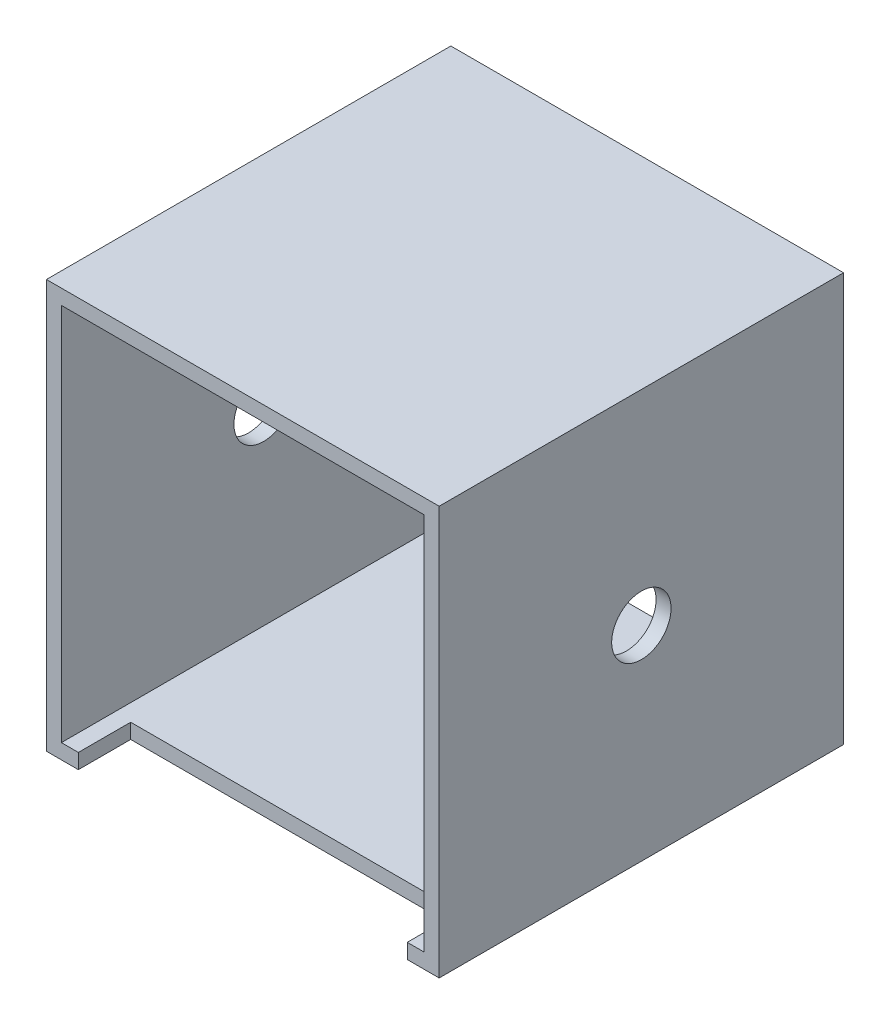
ISO-10303-21;
HEADER;
FILE_DESCRIPTION(('STEP AP214'),'2;1');
FILE_NAME('part.step','',(''),(''),'','','');
FILE_SCHEMA(('AUTOMOTIVE_DESIGN { 1 0 10303 214 1 1 1 1 }'));
ENDSEC;
DATA;
#1=APPLICATION_CONTEXT('core data for automotive mechanical design processes');
#2=APPLICATION_PROTOCOL_DEFINITION('international standard','automotive_design',2000,#1);
#3=PRODUCT_CONTEXT('',#1,'mechanical');
#4=PRODUCT('Part','Part','',(#3));
#5=PRODUCT_RELATED_PRODUCT_CATEGORY('part','',(#4));
#6=PRODUCT_DEFINITION_FORMATION('','',#4);
#7=PRODUCT_DEFINITION_CONTEXT('part definition',#1,'design');
#8=PRODUCT_DEFINITION('design','',#6,#7);
#9=PRODUCT_DEFINITION_SHAPE('','',#8);
#10=(LENGTH_UNIT() NAMED_UNIT(*) SI_UNIT(.MILLI.,.METRE.));
#11=(NAMED_UNIT(*) PLANE_ANGLE_UNIT() SI_UNIT($,.RADIAN.));
#12=(NAMED_UNIT(*) SI_UNIT($,.STERADIAN.) SOLID_ANGLE_UNIT());
#13=UNCERTAINTY_MEASURE_WITH_UNIT(LENGTH_MEASURE(1.E-05),#10,'distance_accuracy_value','');
#14=(GEOMETRIC_REPRESENTATION_CONTEXT(3) GLOBAL_UNCERTAINTY_ASSIGNED_CONTEXT((#13)) GLOBAL_UNIT_ASSIGNED_CONTEXT((#10,
#11,#12)) REPRESENTATION_CONTEXT('',''));
#15=CARTESIAN_POINT('',(0.,0.,0.));
#16=DIRECTION('',(0.,0.,1.));
#17=DIRECTION('',(1.,0.,0.));
#18=AXIS2_PLACEMENT_3D('',#15,#16,#17);
#19=CARTESIAN_POINT('',(0.,0.,68.707));
#20=DIRECTION('',(0.,0.,1.));
#21=DIRECTION('',(1.,0.,0.));
#22=AXIS2_PLACEMENT_3D('',#19,#20,#21);
#23=PLANE('',#22);
#24=DIRECTION('',(0.,1.,0.));
#25=VECTOR('',#24,1.);
#26=CARTESIAN_POINT('',(-27.94,-34.7091,68.707));
#27=LINE('',#26,#25);
#28=CARTESIAN_POINT('',(-27.94,-34.7091,68.707));
#29=VERTEX_POINT('',#28);
#30=CARTESIAN_POINT('',(-27.94,-32.1691,68.707));
#31=VERTEX_POINT('',#30);
#32=EDGE_CURVE('E148',#29,#31,#27,.T.);
#33=ORIENTED_EDGE('',*,*,#32,.T.);
#34=DIRECTION('',(1.,0.,0.));
#35=VECTOR('',#34,1.);
#36=CARTESIAN_POINT('',(0.,-32.1691,68.707));
#37=LINE('',#36,#35);
#38=CARTESIAN_POINT('',(-30.8229,-32.1691,68.707));
#39=VERTEX_POINT('',#38);
#40=EDGE_CURVE('E221',#39,#31,#37,.T.);
#41=ORIENTED_EDGE('',*,*,#40,.F.);
#42=DIRECTION('',(0.,-1.,0.));
#43=VECTOR('',#42,1.);
#44=CARTESIAN_POINT('',(-30.8229,0.,68.707));
#45=LINE('',#44,#43);
#46=CARTESIAN_POINT('',(-30.8229,32.1691,68.707));
#47=VERTEX_POINT('',#46);
#48=EDGE_CURVE('E238',#47,#39,#45,.T.);
#49=ORIENTED_EDGE('',*,*,#48,.F.);
#50=DIRECTION('',(-1.,0.,0.));
#51=VECTOR('',#50,1.);
#52=CARTESIAN_POINT('',(0.,32.1691,68.707));
#53=LINE('',#52,#51);
#54=CARTESIAN_POINT('',(30.8229,32.1691,68.707));
#55=VERTEX_POINT('',#54);
#56=EDGE_CURVE('E240',#55,#47,#53,.T.);
#57=ORIENTED_EDGE('',*,*,#56,.F.);
#58=DIRECTION('',(0.,1.,0.));
#59=VECTOR('',#58,1.);
#60=CARTESIAN_POINT('',(30.8229,0.,68.707));
#61=LINE('',#60,#59);
#62=CARTESIAN_POINT('',(30.8229,-32.1691,68.707));
#63=VERTEX_POINT('',#62);
#64=EDGE_CURVE('E225',#63,#55,#61,.T.);
#65=ORIENTED_EDGE('',*,*,#64,.F.);
#66=CARTESIAN_POINT('',(27.94,-32.1691,68.707));
#67=VERTEX_POINT('',#66);
#68=EDGE_CURVE('E237',#67,#63,#37,.T.);
#69=ORIENTED_EDGE('',*,*,#68,.F.);
#70=DIRECTION('',(0.,1.,0.));
#71=VECTOR('',#70,1.);
#72=CARTESIAN_POINT('',(27.94,-34.7091,68.707));
#73=LINE('',#72,#71);
#74=CARTESIAN_POINT('',(27.94,-34.7091,68.707));
#75=VERTEX_POINT('',#74);
#76=EDGE_CURVE('E72',#75,#67,#73,.T.);
#77=ORIENTED_EDGE('',*,*,#76,.F.);
#78=DIRECTION('',(1.,0.,0.));
#79=VECTOR('',#78,1.);
#80=CARTESIAN_POINT('',(-33.3629,-34.7091,68.707));
#81=LINE('',#80,#79);
#82=CARTESIAN_POINT('',(33.3629,-34.7091,68.707));
#83=VERTEX_POINT('',#82);
#84=EDGE_CURVE('E174',#75,#83,#81,.T.);
#85=ORIENTED_EDGE('',*,*,#84,.T.);
#86=DIRECTION('',(0.,1.,0.));
#87=VECTOR('',#86,1.);
#88=CARTESIAN_POINT('',(33.3629,-34.7091,68.707));
#89=LINE('',#88,#87);
#90=CARTESIAN_POINT('',(33.3629,34.7091,68.707));
#91=VERTEX_POINT('',#90);
#92=EDGE_CURVE('E191',#83,#91,#89,.T.);
#93=ORIENTED_EDGE('',*,*,#92,.T.);
#94=DIRECTION('',(-1.,0.,0.));
#95=VECTOR('',#94,1.);
#96=CARTESIAN_POINT('',(-33.3629,34.7091,68.707));
#97=LINE('',#96,#95);
#98=CARTESIAN_POINT('',(-33.3629,34.7091,68.707));
#99=VERTEX_POINT('',#98);
#100=EDGE_CURVE('E210',#91,#99,#97,.T.);
#101=ORIENTED_EDGE('',*,*,#100,.T.);
#102=DIRECTION('',(0.,-1.,0.));
#103=VECTOR('',#102,1.);
#104=CARTESIAN_POINT('',(-33.3629,-34.7091,68.707));
#105=LINE('',#104,#103);
#106=CARTESIAN_POINT('',(-33.3629,-34.7091,68.707));
#107=VERTEX_POINT('',#106);
#108=EDGE_CURVE('E171',#99,#107,#105,.T.);
#109=ORIENTED_EDGE('',*,*,#108,.T.);
#110=EDGE_CURVE('E164',#107,#29,#81,.T.);
#111=ORIENTED_EDGE('',*,*,#110,.T.);
#112=EDGE_LOOP('',(#33,#41,#49,#57,#65,#69,#77,#85,#93,#101,#109,#111));
#113=FACE_BOUND('',#112,.T.);
#114=ADVANCED_FACE('F57',(#113),#23,.T.);
#115=CARTESIAN_POINT('',(0.,0.,0.));
#116=DIRECTION('',(0.,0.,1.));
#117=DIRECTION('',(1.,0.,0.));
#118=AXIS2_PLACEMENT_3D('',#115,#116,#117);
#119=PLANE('',#118);
#120=DIRECTION('',(0.,1.,0.));
#121=VECTOR('',#120,1.);
#122=CARTESIAN_POINT('',(33.3629,-34.7091,0.));
#123=LINE('',#122,#121);
#124=CARTESIAN_POINT('',(33.3629,-34.7091,0.));
#125=VERTEX_POINT('',#124);
#126=CARTESIAN_POINT('',(33.3629,34.7091,0.));
#127=VERTEX_POINT('',#126);
#128=EDGE_CURVE('E182',#125,#127,#123,.T.);
#129=ORIENTED_EDGE('',*,*,#128,.F.);
#130=DIRECTION('',(1.,0.,0.));
#131=VECTOR('',#130,1.);
#132=CARTESIAN_POINT('',(-33.3629,-34.7091,0.));
#133=LINE('',#132,#131);
#134=CARTESIAN_POINT('',(-33.3629,-34.7091,0.));
#135=VERTEX_POINT('',#134);
#136=EDGE_CURVE('E190',#135,#125,#133,.T.);
#137=ORIENTED_EDGE('',*,*,#136,.F.);
#138=DIRECTION('',(0.,-1.,0.));
#139=VECTOR('',#138,1.);
#140=CARTESIAN_POINT('',(-33.3629,-34.7091,0.));
#141=LINE('',#140,#139);
#142=CARTESIAN_POINT('',(-33.3629,34.7091,0.));
#143=VERTEX_POINT('',#142);
#144=EDGE_CURVE('E188',#143,#135,#141,.T.);
#145=ORIENTED_EDGE('',*,*,#144,.F.);
#146=DIRECTION('',(-1.,0.,0.));
#147=VECTOR('',#146,1.);
#148=CARTESIAN_POINT('',(-33.3629,34.7091,0.));
#149=LINE('',#148,#147);
#150=EDGE_CURVE('E185',#127,#143,#149,.T.);
#151=ORIENTED_EDGE('',*,*,#150,.F.);
#152=EDGE_LOOP('',(#129,#137,#145,#151));
#153=FACE_BOUND('',#152,.T.);
#154=DIRECTION('',(0.,1.,0.));
#155=VECTOR('',#154,1.);
#156=CARTESIAN_POINT('',(30.8229,0.,0.));
#157=LINE('',#156,#155);
#158=CARTESIAN_POINT('',(30.8229,-32.1691,0.));
#159=VERTEX_POINT('',#158);
#160=CARTESIAN_POINT('',(30.8229,32.1691,0.));
#161=VERTEX_POINT('',#160);
#162=EDGE_CURVE('E232',#159,#161,#157,.T.);
#163=ORIENTED_EDGE('',*,*,#162,.T.);
#164=DIRECTION('',(-1.,0.,0.));
#165=VECTOR('',#164,1.);
#166=CARTESIAN_POINT('',(0.,32.1691,0.));
#167=LINE('',#166,#165);
#168=CARTESIAN_POINT('',(-30.8229,32.1691,0.));
#169=VERTEX_POINT('',#168);
#170=EDGE_CURVE('E229',#161,#169,#167,.T.);
#171=ORIENTED_EDGE('',*,*,#170,.T.);
#172=DIRECTION('',(0.,-1.,0.));
#173=VECTOR('',#172,1.);
#174=CARTESIAN_POINT('',(-30.8229,0.,0.));
#175=LINE('',#174,#173);
#176=CARTESIAN_POINT('',(-30.8229,-32.1691,0.));
#177=VERTEX_POINT('',#176);
#178=EDGE_CURVE('E226',#169,#177,#175,.T.);
#179=ORIENTED_EDGE('',*,*,#178,.T.);
#180=DIRECTION('',(1.,0.,0.));
#181=VECTOR('',#180,1.);
#182=CARTESIAN_POINT('',(0.,-32.1691,0.));
#183=LINE('',#182,#181);
#184=EDGE_CURVE('E222',#177,#159,#183,.T.);
#185=ORIENTED_EDGE('',*,*,#184,.T.);
#186=EDGE_LOOP('',(#163,#171,#179,#185));
#187=FACE_BOUND('',#186,.T.);
#188=ADVANCED_FACE('F202',(#153,#187),#119,.F.);
#189=CARTESIAN_POINT('',(33.3629,-34.7091,68.707));
#190=DIRECTION('',(-1.,0.,0.));
#191=DIRECTION('',(0.,0.,1.));
#192=AXIS2_PLACEMENT_3D('',#189,#190,#191);
#193=PLANE('',#192);
#194=CARTESIAN_POINT('',(33.3629,0.,34.3535));
#195=DIRECTION('',(1.,0.,0.));
#196=DIRECTION('',(0.,0.,-1.));
#197=AXIS2_PLACEMENT_3D('',#194,#195,#196);
#198=CIRCLE('',#197,5.04189999999999);
#199=CARTESIAN_POINT('',(33.3629,0.,29.3116));
#200=VERTEX_POINT('',#199);
#201=EDGE_CURVE('E251',#200,#200,#198,.T.);
#202=ORIENTED_EDGE('',*,*,#201,.F.);
#203=EDGE_LOOP('',(#202));
#204=FACE_BOUND('',#203,.T.);
#205=ORIENTED_EDGE('',*,*,#128,.T.);
#206=DIRECTION('',(0.,0.,-1.));
#207=VECTOR('',#206,1.);
#208=CARTESIAN_POINT('',(33.3629,34.7091,68.707));
#209=LINE('',#208,#207);
#210=EDGE_CURVE('E12',#91,#127,#209,.T.);
#211=ORIENTED_EDGE('',*,*,#210,.F.);
#212=ORIENTED_EDGE('',*,*,#92,.F.);
#213=DIRECTION('',(0.,0.,-1.));
#214=VECTOR('',#213,1.);
#215=CARTESIAN_POINT('',(33.3629,-34.7091,68.707));
#216=LINE('',#215,#214);
#217=EDGE_CURVE('E173',#83,#125,#216,.T.);
#218=ORIENTED_EDGE('',*,*,#217,.T.);
#219=EDGE_LOOP('',(#205,#211,#212,#218));
#220=FACE_BOUND('',#219,.T.);
#221=ADVANCED_FACE('F59',(#204,#220),#193,.F.);
#222=CARTESIAN_POINT('',(-33.3629,34.7091,68.707));
#223=DIRECTION('',(0.,-1.,0.));
#224=DIRECTION('',(0.,0.,-1.));
#225=AXIS2_PLACEMENT_3D('',#222,#223,#224);
#226=PLANE('',#225);
#227=ORIENTED_EDGE('',*,*,#150,.T.);
#228=DIRECTION('',(0.,0.,-1.));
#229=VECTOR('',#228,1.);
#230=CARTESIAN_POINT('',(-33.3629,34.7091,68.707));
#231=LINE('',#230,#229);
#232=EDGE_CURVE('E65',#99,#143,#231,.T.);
#233=ORIENTED_EDGE('',*,*,#232,.F.);
#234=ORIENTED_EDGE('',*,*,#100,.F.);
#235=ORIENTED_EDGE('',*,*,#210,.T.);
#236=EDGE_LOOP('',(#227,#233,#234,#235));
#237=FACE_BOUND('',#236,.T.);
#238=ADVANCED_FACE('F303',(#237),#226,.F.);
#239=CARTESIAN_POINT('',(-33.3629,-34.7091,68.707));
#240=DIRECTION('',(1.,0.,0.));
#241=DIRECTION('',(0.,0.,-1.));
#242=AXIS2_PLACEMENT_3D('',#239,#240,#241);
#243=PLANE('',#242);
#244=CARTESIAN_POINT('',(-33.3629,0.,34.3535));
#245=DIRECTION('',(1.,0.,0.));
#246=DIRECTION('',(0.,0.,-1.));
#247=AXIS2_PLACEMENT_3D('',#244,#245,#246);
#248=CIRCLE('',#247,5.04189999999998);
#249=CARTESIAN_POINT('',(-33.3629,0.,29.3116));
#250=VERTEX_POINT('',#249);
#251=EDGE_CURVE('E248',#250,#250,#248,.T.);
#252=ORIENTED_EDGE('',*,*,#251,.T.);
#253=EDGE_LOOP('',(#252));
#254=FACE_BOUND('',#253,.T.);
#255=ORIENTED_EDGE('',*,*,#144,.T.);
#256=DIRECTION('',(0.,0.,-1.));
#257=VECTOR('',#256,1.);
#258=CARTESIAN_POINT('',(-33.3629,-34.7091,68.707));
#259=LINE('',#258,#257);
#260=EDGE_CURVE('E177',#107,#135,#259,.T.);
#261=ORIENTED_EDGE('',*,*,#260,.F.);
#262=ORIENTED_EDGE('',*,*,#108,.F.);
#263=ORIENTED_EDGE('',*,*,#232,.T.);
#264=EDGE_LOOP('',(#255,#261,#262,#263));
#265=FACE_BOUND('',#264,.T.);
#266=ADVANCED_FACE('F197',(#254,#265),#243,.F.);
#267=CARTESIAN_POINT('',(-33.3629,-34.7091,68.707));
#268=DIRECTION('',(0.,1.,0.));
#269=DIRECTION('',(0.,0.,1.));
#270=AXIS2_PLACEMENT_3D('',#267,#268,#269);
#271=PLANE('',#270);
#272=DIRECTION('',(-1.,0.,0.));
#273=VECTOR('',#272,1.);
#274=CARTESIAN_POINT('',(-27.94,-34.7091,59.817));
#275=LINE('',#274,#273);
#276=CARTESIAN_POINT('',(27.94,-34.7091,59.817));
#277=VERTEX_POINT('',#276);
#278=CARTESIAN_POINT('',(-27.94,-34.7091,59.817));
#279=VERTEX_POINT('',#278);
#280=EDGE_CURVE('E158',#277,#279,#275,.T.);
#281=ORIENTED_EDGE('',*,*,#280,.T.);
#282=DIRECTION('',(0.,0.,1.));
#283=VECTOR('',#282,1.);
#284=CARTESIAN_POINT('',(-27.94,-34.7091,68.707));
#285=LINE('',#284,#283);
#286=EDGE_CURVE('E151',#279,#29,#285,.T.);
#287=ORIENTED_EDGE('',*,*,#286,.T.);
#288=ORIENTED_EDGE('',*,*,#110,.F.);
#289=ORIENTED_EDGE('',*,*,#260,.T.);
#290=ORIENTED_EDGE('',*,*,#136,.T.);
#291=ORIENTED_EDGE('',*,*,#217,.F.);
#292=ORIENTED_EDGE('',*,*,#84,.F.);
#293=DIRECTION('',(0.,0.,-1.));
#294=VECTOR('',#293,1.);
#295=CARTESIAN_POINT('',(27.94,-34.7091,68.707));
#296=LINE('',#295,#294);
#297=EDGE_CURVE('E167',#75,#277,#296,.T.);
#298=ORIENTED_EDGE('',*,*,#297,.T.);
#299=EDGE_LOOP('',(#281,#287,#288,#289,#290,#291,#292,#298));
#300=FACE_BOUND('',#299,.T.);
#301=ADVANCED_FACE('F162',(#300),#271,.F.);
#302=CARTESIAN_POINT('',(30.8229,0.,68.707));
#303=DIRECTION('',(-1.,0.,0.));
#304=DIRECTION('',(0.,0.,1.));
#305=AXIS2_PLACEMENT_3D('',#302,#303,#304);
#306=PLANE('',#305);
#307=CARTESIAN_POINT('',(30.8229,0.,34.3535));
#308=DIRECTION('',(-1.,0.,0.));
#309=DIRECTION('',(0.,0.,1.));
#310=AXIS2_PLACEMENT_3D('',#307,#308,#309);
#311=CIRCLE('',#310,5.04189999999999);
#312=CARTESIAN_POINT('',(30.8229,0.,39.3954));
#313=VERTEX_POINT('',#312);
#314=EDGE_CURVE('E235',#313,#313,#311,.T.);
#315=ORIENTED_EDGE('',*,*,#314,.F.);
#316=EDGE_LOOP('',(#315));
#317=FACE_BOUND('',#316,.T.);
#318=ORIENTED_EDGE('',*,*,#162,.F.);
#319=DIRECTION('',(0.,0.,-1.));
#320=VECTOR('',#319,1.);
#321=CARTESIAN_POINT('',(30.8229,-32.1691,68.707));
#322=LINE('',#321,#320);
#323=EDGE_CURVE('E218',#63,#159,#322,.T.);
#324=ORIENTED_EDGE('',*,*,#323,.F.);
#325=ORIENTED_EDGE('',*,*,#64,.T.);
#326=DIRECTION('',(0.,0.,-1.));
#327=VECTOR('',#326,1.);
#328=CARTESIAN_POINT('',(30.8229,32.1691,68.707));
#329=LINE('',#328,#327);
#330=EDGE_CURVE('E186',#55,#161,#329,.T.);
#331=ORIENTED_EDGE('',*,*,#330,.T.);
#332=EDGE_LOOP('',(#318,#324,#325,#331));
#333=FACE_BOUND('',#332,.T.);
#334=ADVANCED_FACE('F273',(#317,#333),#306,.T.);
#335=CARTESIAN_POINT('',(0.,32.1691,68.707));
#336=DIRECTION('',(0.,-1.,0.));
#337=DIRECTION('',(0.,0.,-1.));
#338=AXIS2_PLACEMENT_3D('',#335,#336,#337);
#339=PLANE('',#338);
#340=ORIENTED_EDGE('',*,*,#170,.F.);
#341=ORIENTED_EDGE('',*,*,#330,.F.);
#342=ORIENTED_EDGE('',*,*,#56,.T.);
#343=DIRECTION('',(0.,0.,-1.));
#344=VECTOR('',#343,1.);
#345=CARTESIAN_POINT('',(-30.8229,32.1691,68.707));
#346=LINE('',#345,#344);
#347=EDGE_CURVE('E215',#47,#169,#346,.T.);
#348=ORIENTED_EDGE('',*,*,#347,.T.);
#349=EDGE_LOOP('',(#340,#341,#342,#348));
#350=FACE_BOUND('',#349,.T.);
#351=ADVANCED_FACE('F326',(#350),#339,.T.);
#352=CARTESIAN_POINT('',(-30.8229,0.,68.707));
#353=DIRECTION('',(1.,0.,0.));
#354=DIRECTION('',(0.,0.,-1.));
#355=AXIS2_PLACEMENT_3D('',#352,#353,#354);
#356=PLANE('',#355);
#357=CARTESIAN_POINT('',(-30.8229,0.,34.3535));
#358=DIRECTION('',(1.,0.,0.));
#359=DIRECTION('',(0.,0.,-1.));
#360=AXIS2_PLACEMENT_3D('',#357,#358,#359);
#361=CIRCLE('',#360,5.04189999999999);
#362=CARTESIAN_POINT('',(-30.8229,0.,29.3116));
#363=VERTEX_POINT('',#362);
#364=EDGE_CURVE('E245',#363,#363,#361,.T.);
#365=ORIENTED_EDGE('',*,*,#364,.F.);
#366=EDGE_LOOP('',(#365));
#367=FACE_BOUND('',#366,.T.);
#368=ORIENTED_EDGE('',*,*,#178,.F.);
#369=ORIENTED_EDGE('',*,*,#347,.F.);
#370=ORIENTED_EDGE('',*,*,#48,.T.);
#371=DIRECTION('',(0.,0.,-1.));
#372=VECTOR('',#371,1.);
#373=CARTESIAN_POINT('',(-30.8229,-32.1691,68.707));
#374=LINE('',#373,#372);
#375=EDGE_CURVE('E80',#39,#177,#374,.T.);
#376=ORIENTED_EDGE('',*,*,#375,.T.);
#377=EDGE_LOOP('',(#368,#369,#370,#376));
#378=FACE_BOUND('',#377,.T.);
#379=ADVANCED_FACE('F278',(#367,#378),#356,.T.);
#380=CARTESIAN_POINT('',(0.,-32.1691,68.707));
#381=DIRECTION('',(0.,1.,0.));
#382=DIRECTION('',(0.,0.,1.));
#383=AXIS2_PLACEMENT_3D('',#380,#381,#382);
#384=PLANE('',#383);
#385=DIRECTION('',(0.,0.,1.));
#386=VECTOR('',#385,1.);
#387=CARTESIAN_POINT('',(-27.94,-32.1691,68.707));
#388=LINE('',#387,#386);
#389=CARTESIAN_POINT('',(-27.94,-32.1691,59.817));
#390=VERTEX_POINT('',#389);
#391=EDGE_CURVE('E154',#390,#31,#388,.T.);
#392=ORIENTED_EDGE('',*,*,#391,.F.);
#393=DIRECTION('',(-1.,0.,0.));
#394=VECTOR('',#393,1.);
#395=CARTESIAN_POINT('',(-27.94,-32.1691,59.817));
#396=LINE('',#395,#394);
#397=CARTESIAN_POINT('',(27.94,-32.1691,59.817));
#398=VERTEX_POINT('',#397);
#399=EDGE_CURVE('E168',#398,#390,#396,.T.);
#400=ORIENTED_EDGE('',*,*,#399,.F.);
#401=DIRECTION('',(0.,0.,-1.));
#402=VECTOR('',#401,1.);
#403=CARTESIAN_POINT('',(27.94,-32.1691,68.707));
#404=LINE('',#403,#402);
#405=EDGE_CURVE('E261',#67,#398,#404,.T.);
#406=ORIENTED_EDGE('',*,*,#405,.F.);
#407=ORIENTED_EDGE('',*,*,#68,.T.);
#408=ORIENTED_EDGE('',*,*,#323,.T.);
#409=ORIENTED_EDGE('',*,*,#184,.F.);
#410=ORIENTED_EDGE('',*,*,#375,.F.);
#411=ORIENTED_EDGE('',*,*,#40,.T.);
#412=EDGE_LOOP('',(#392,#400,#406,#407,#408,#409,#410,#411));
#413=FACE_BOUND('',#412,.T.);
#414=ADVANCED_FACE('F270',(#413),#384,.T.);
#415=CARTESIAN_POINT('',(33.3629,0.,34.3535));
#416=DIRECTION('',(1.,0.,0.));
#417=DIRECTION('',(0.,0.,-1.));
#418=AXIS2_PLACEMENT_3D('',#415,#416,#417);
#419=CYLINDRICAL_SURFACE('',#418,5.04189999999999);
#420=ORIENTED_EDGE('',*,*,#314,.T.);
#421=EDGE_LOOP('',(#420));
#422=FACE_BOUND('',#421,.T.);
#423=ORIENTED_EDGE('',*,*,#201,.T.);
#424=EDGE_LOOP('',(#423));
#425=FACE_BOUND('',#424,.T.);
#426=ADVANCED_FACE('F314',(#422,#425),#419,.F.);
#427=ORIENTED_EDGE('',*,*,#364,.T.);
#428=EDGE_LOOP('',(#427));
#429=FACE_BOUND('',#428,.T.);
#430=ORIENTED_EDGE('',*,*,#251,.F.);
#431=EDGE_LOOP('',(#430));
#432=FACE_BOUND('',#431,.T.);
#433=ADVANCED_FACE('F289',(#429,#432),#419,.F.);
#434=CARTESIAN_POINT('',(-27.94,-34.7091,68.707));
#435=DIRECTION('',(-1.,0.,0.));
#436=DIRECTION('',(0.,0.,1.));
#437=AXIS2_PLACEMENT_3D('',#434,#435,#436);
#438=PLANE('',#437);
#439=ORIENTED_EDGE('',*,*,#391,.T.);
#440=ORIENTED_EDGE('',*,*,#32,.F.);
#441=ORIENTED_EDGE('',*,*,#286,.F.);
#442=DIRECTION('',(0.,1.,0.));
#443=VECTOR('',#442,1.);
#444=CARTESIAN_POINT('',(-27.94,-34.7091,59.817));
#445=LINE('',#444,#443);
#446=EDGE_CURVE('E253',#279,#390,#445,.T.);
#447=ORIENTED_EDGE('',*,*,#446,.T.);
#448=EDGE_LOOP('',(#439,#440,#441,#447));
#449=FACE_BOUND('',#448,.T.);
#450=ADVANCED_FACE('F150',(#449),#438,.F.);
#451=CARTESIAN_POINT('',(-27.94,-34.7091,59.817));
#452=DIRECTION('',(0.,0.,-1.));
#453=DIRECTION('',(-1.,0.,0.));
#454=AXIS2_PLACEMENT_3D('',#451,#452,#453);
#455=PLANE('',#454);
#456=ORIENTED_EDGE('',*,*,#399,.T.);
#457=ORIENTED_EDGE('',*,*,#446,.F.);
#458=ORIENTED_EDGE('',*,*,#280,.F.);
#459=DIRECTION('',(0.,1.,0.));
#460=VECTOR('',#459,1.);
#461=CARTESIAN_POINT('',(27.94,-34.7091,59.817));
#462=LINE('',#461,#460);
#463=EDGE_CURVE('E256',#277,#398,#462,.T.);
#464=ORIENTED_EDGE('',*,*,#463,.T.);
#465=EDGE_LOOP('',(#456,#457,#458,#464));
#466=FACE_BOUND('',#465,.T.);
#467=ADVANCED_FACE('F281',(#466),#455,.F.);
#468=CARTESIAN_POINT('',(27.94,-34.7091,68.707));
#469=DIRECTION('',(1.,0.,0.));
#470=DIRECTION('',(0.,0.,-1.));
#471=AXIS2_PLACEMENT_3D('',#468,#469,#470);
#472=PLANE('',#471);
#473=ORIENTED_EDGE('',*,*,#405,.T.);
#474=ORIENTED_EDGE('',*,*,#463,.F.);
#475=ORIENTED_EDGE('',*,*,#297,.F.);
#476=ORIENTED_EDGE('',*,*,#76,.T.);
#477=EDGE_LOOP('',(#473,#474,#475,#476));
#478=FACE_BOUND('',#477,.T.);
#479=ADVANCED_FACE('F265',(#478),#472,.F.);
#480=CLOSED_SHELL('',(#114,#188,#221,#238,#266,#301,#334,#351,#379,#414,#426,#433,#450,#467,#479));
#481=MANIFOLD_SOLID_BREP('B2',#480);
#482=ADVANCED_BREP_SHAPE_REPRESENTATION('',(#18,#481),#14);
#483=SHAPE_DEFINITION_REPRESENTATION(#9,#482);
ENDSEC;
END-ISO-10303-21;
